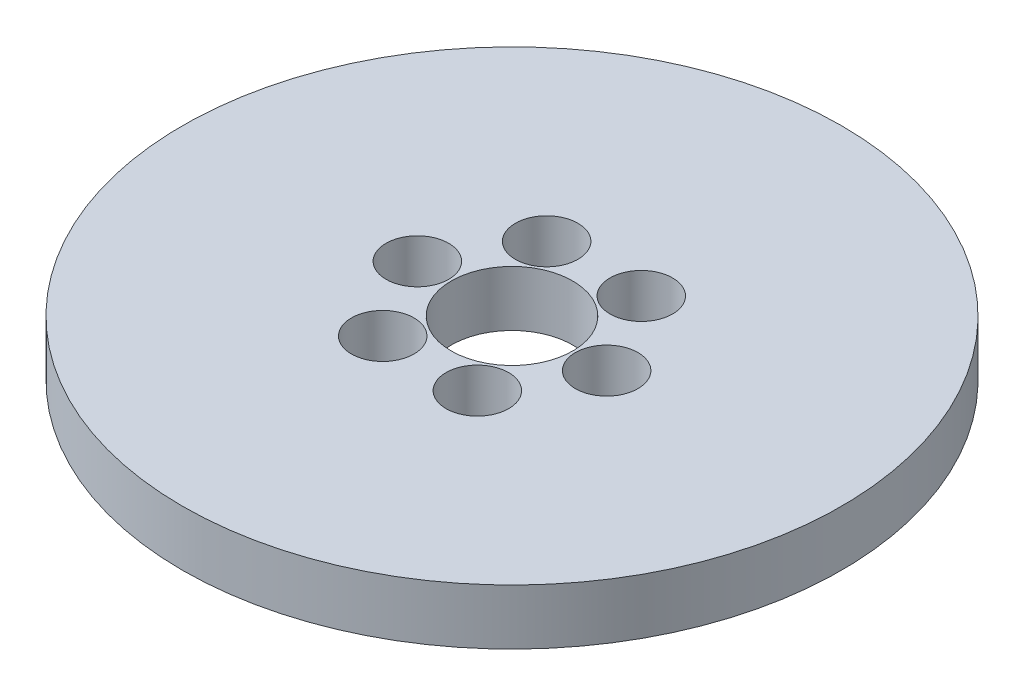
ISO-10303-21;
HEADER;
FILE_DESCRIPTION(('STEP AP214'),'2;1');
FILE_NAME('part.step','',(''),(''),'','','');
FILE_SCHEMA(('AUTOMOTIVE_DESIGN { 1 0 10303 214 1 1 1 1 }'));
ENDSEC;
DATA;
#1=APPLICATION_CONTEXT('core data for automotive mechanical design processes');
#2=APPLICATION_PROTOCOL_DEFINITION('international standard','automotive_design',2000,#1);
#3=PRODUCT_CONTEXT('',#1,'mechanical');
#4=PRODUCT('Part','Part','',(#3));
#5=PRODUCT_RELATED_PRODUCT_CATEGORY('part','',(#4));
#6=PRODUCT_DEFINITION_FORMATION('','',#4);
#7=PRODUCT_DEFINITION_CONTEXT('part definition',#1,'design');
#8=PRODUCT_DEFINITION('design','',#6,#7);
#9=PRODUCT_DEFINITION_SHAPE('','',#8);
#10=(LENGTH_UNIT() NAMED_UNIT(*) SI_UNIT(.MILLI.,.METRE.));
#11=(NAMED_UNIT(*) PLANE_ANGLE_UNIT() SI_UNIT($,.RADIAN.));
#12=(NAMED_UNIT(*) SI_UNIT($,.STERADIAN.) SOLID_ANGLE_UNIT());
#13=UNCERTAINTY_MEASURE_WITH_UNIT(LENGTH_MEASURE(1.E-05),#10,'distance_accuracy_value','');
#14=(GEOMETRIC_REPRESENTATION_CONTEXT(3) GLOBAL_UNCERTAINTY_ASSIGNED_CONTEXT((#13)) GLOBAL_UNIT_ASSIGNED_CONTEXT((#10,
#11,#12)) REPRESENTATION_CONTEXT('',''));
#15=CARTESIAN_POINT('',(0.,0.,0.));
#16=DIRECTION('',(0.,0.,1.));
#17=DIRECTION('',(1.,0.,0.));
#18=AXIS2_PLACEMENT_3D('',#15,#16,#17);
#19=CARTESIAN_POINT('',(0.,16.,0.));
#20=DIRECTION('',(0.,-1.,0.));
#21=DIRECTION('',(0.,0.,-1.));
#22=AXIS2_PLACEMENT_3D('',#19,#20,#21);
#23=CYLINDRICAL_SURFACE('',#22,95.);
#24=CARTESIAN_POINT('',(0.,16.,0.));
#25=DIRECTION('',(0.,1.,0.));
#26=DIRECTION('',(0.,0.,1.));
#27=AXIS2_PLACEMENT_3D('',#24,#25,#26);
#28=CIRCLE('',#27,95.);
#29=CARTESIAN_POINT('',(0.,16.,95.));
#30=VERTEX_POINT('',#29);
#31=EDGE_CURVE('E10',#30,#30,#28,.T.);
#32=ORIENTED_EDGE('',*,*,#31,.F.);
#33=EDGE_LOOP('',(#32));
#34=FACE_BOUND('',#33,.T.);
#35=CARTESIAN_POINT('',(0.,0.,0.));
#36=DIRECTION('',(0.,1.,0.));
#37=DIRECTION('',(0.,0.,1.));
#38=AXIS2_PLACEMENT_3D('',#35,#36,#37);
#39=CIRCLE('',#38,95.);
#40=CARTESIAN_POINT('',(0.,0.,95.));
#41=VERTEX_POINT('',#40);
#42=EDGE_CURVE('E37',#41,#41,#39,.T.);
#43=ORIENTED_EDGE('',*,*,#42,.T.);
#44=EDGE_LOOP('',(#43));
#45=FACE_BOUND('',#44,.T.);
#46=ADVANCED_FACE('F40',(#34,#45),#23,.T.);
#47=CARTESIAN_POINT('',(0.,16.,0.));
#48=DIRECTION('',(0.,1.,0.));
#49=DIRECTION('',(0.,0.,1.));
#50=AXIS2_PLACEMENT_3D('',#47,#48,#49);
#51=PLANE('',#50);
#52=CARTESIAN_POINT('',(-13.6417250650911,16.,-23.6281609156231));
#53=DIRECTION('',(0.,1.,0.));
#54=DIRECTION('',(-0.866025403784433,0.,0.50000000000001));
#55=AXIS2_PLACEMENT_3D('',#52,#53,#54);
#56=CIRCLE('',#55,9.02133893008124);
#57=CARTESIAN_POINT('',(-21.454433754691,16.,-19.1174914505824));
#58=VERTEX_POINT('',#57);
#59=EDGE_CURVE('E70',#58,#58,#56,.T.);
#60=ORIENTED_EDGE('',*,*,#59,.F.);
#61=EDGE_LOOP('',(#60));
#62=FACE_BOUND('',#61,.T.);
#63=CARTESIAN_POINT('',(13.6417250650906,16.,-23.6281609156234));
#64=DIRECTION('',(0.,1.,0.));
#65=DIRECTION('',(-0.866025403784443,0.,-0.499999999999992));
#66=AXIS2_PLACEMENT_3D('',#63,#64,#65);
#67=CIRCLE('',#66,9.02133893008124);
#68=CARTESIAN_POINT('',(5.82901637549073,16.,-28.1388303806639));
#69=VERTEX_POINT('',#68);
#70=EDGE_CURVE('E71',#69,#69,#67,.T.);
#71=ORIENTED_EDGE('',*,*,#70,.F.);
#72=EDGE_LOOP('',(#71));
#73=FACE_BOUND('',#72,.T.);
#74=CARTESIAN_POINT('',(27.2834501301817,16.,0.));
#75=DIRECTION('',(0.,1.,0.));
#76=DIRECTION('',(0.,0.,-1.));
#77=AXIS2_PLACEMENT_3D('',#74,#75,#76);
#78=CIRCLE('',#77,9.02133893008124);
#79=CARTESIAN_POINT('',(27.2834501301817,16.,-9.02133893008124));
#80=VERTEX_POINT('',#79);
#81=EDGE_CURVE('E78',#80,#80,#78,.T.);
#82=ORIENTED_EDGE('',*,*,#81,.F.);
#83=EDGE_LOOP('',(#82));
#84=FACE_BOUND('',#83,.T.);
#85=CARTESIAN_POINT('',(13.641725065091,16.,23.6281609156232));
#86=DIRECTION('',(0.,1.,0.));
#87=DIRECTION('',(0.866025403784436,0.,-0.500000000000004));
#88=AXIS2_PLACEMENT_3D('',#85,#86,#87);
#89=CIRCLE('',#88,9.02133893008124);
#90=CARTESIAN_POINT('',(21.4544337546908,16.,19.1174914505825));
#91=VERTEX_POINT('',#90);
#92=EDGE_CURVE('E84',#91,#91,#89,.T.);
#93=ORIENTED_EDGE('',*,*,#92,.F.);
#94=EDGE_LOOP('',(#93));
#95=FACE_BOUND('',#94,.T.);
#96=CARTESIAN_POINT('',(-13.6417250650908,16.,23.6281609156233));
#97=DIRECTION('',(0.,1.,0.));
#98=DIRECTION('',(0.86602540378444,0.,0.499999999999998));
#99=AXIS2_PLACEMENT_3D('',#96,#97,#98);
#100=CIRCLE('',#99,9.02133893008124);
#101=CARTESIAN_POINT('',(-5.82901637549092,16.,28.1388303806639));
#102=VERTEX_POINT('',#101);
#103=EDGE_CURVE('E61',#102,#102,#100,.T.);
#104=ORIENTED_EDGE('',*,*,#103,.F.);
#105=EDGE_LOOP('',(#104));
#106=FACE_BOUND('',#105,.T.);
#107=CARTESIAN_POINT('',(-27.2834501301817,16.,0.));
#108=DIRECTION('',(0.,1.,0.));
#109=DIRECTION('',(0.,0.,1.));
#110=AXIS2_PLACEMENT_3D('',#107,#108,#109);
#111=CIRCLE('',#110,9.02133893008124);
#112=CARTESIAN_POINT('',(-27.2834501301817,16.,9.02133893008124));
#113=VERTEX_POINT('',#112);
#114=EDGE_CURVE('E54',#113,#113,#111,.T.);
#115=ORIENTED_EDGE('',*,*,#114,.F.);
#116=EDGE_LOOP('',(#115));
#117=FACE_BOUND('',#116,.T.);
#118=CARTESIAN_POINT('',(0.,16.,0.));
#119=DIRECTION('',(0.,1.,0.));
#120=DIRECTION('',(0.,0.,1.));
#121=AXIS2_PLACEMENT_3D('',#118,#119,#120);
#122=CIRCLE('',#121,17.5);
#123=CARTESIAN_POINT('',(0.,16.,17.5));
#124=VERTEX_POINT('',#123);
#125=EDGE_CURVE('E50',#124,#124,#122,.T.);
#126=ORIENTED_EDGE('',*,*,#125,.F.);
#127=EDGE_LOOP('',(#126));
#128=FACE_BOUND('',#127,.T.);
#129=ORIENTED_EDGE('',*,*,#31,.T.);
#130=EDGE_LOOP('',(#129));
#131=FACE_BOUND('',#130,.T.);
#132=ADVANCED_FACE('F99',(#62,#73,#84,#95,#106,#117,#128,#131),#51,.T.);
#133=CARTESIAN_POINT('',(0.,0.,0.));
#134=DIRECTION('',(0.,1.,0.));
#135=DIRECTION('',(0.,0.,1.));
#136=AXIS2_PLACEMENT_3D('',#133,#134,#135);
#137=PLANE('',#136);
#138=CARTESIAN_POINT('',(0.,0.,0.));
#139=DIRECTION('',(0.,1.,0.));
#140=DIRECTION('',(0.,0.,1.));
#141=AXIS2_PLACEMENT_3D('',#138,#139,#140);
#142=CIRCLE('',#141,17.5);
#143=CARTESIAN_POINT('',(0.,0.,17.5));
#144=VERTEX_POINT('',#143);
#145=EDGE_CURVE('E47',#144,#144,#142,.T.);
#146=ORIENTED_EDGE('',*,*,#145,.T.);
#147=EDGE_LOOP('',(#146));
#148=FACE_BOUND('',#147,.T.);
#149=ORIENTED_EDGE('',*,*,#42,.F.);
#150=EDGE_LOOP('',(#149));
#151=FACE_BOUND('',#150,.T.);
#152=ADVANCED_FACE('F103',(#148,#151),#137,.F.);
#153=CARTESIAN_POINT('',(0.,16.,0.));
#154=DIRECTION('',(0.,-1.,0.));
#155=DIRECTION('',(0.,0.,-1.));
#156=AXIS2_PLACEMENT_3D('',#153,#154,#155);
#157=CYLINDRICAL_SURFACE('',#156,17.5);
#158=ORIENTED_EDGE('',*,*,#125,.T.);
#159=EDGE_LOOP('',(#158));
#160=FACE_BOUND('',#159,.T.);
#161=ORIENTED_EDGE('',*,*,#145,.F.);
#162=EDGE_LOOP('',(#161));
#163=FACE_BOUND('',#162,.T.);
#164=ADVANCED_FACE('F115',(#160,#163),#157,.F.);
#165=CARTESIAN_POINT('',(-27.2834501301817,0.0606863577741236,0.));
#166=DIRECTION('',(0.,1.,0.));
#167=DIRECTION('',(0.,0.,1.));
#168=AXIS2_PLACEMENT_3D('',#165,#166,#167);
#169=CYLINDRICAL_SURFACE('',#168,9.02133893008124);
#170=CARTESIAN_POINT('',(-27.2834501301817,0.0606863577741236,0.));
#171=DIRECTION('',(0.,1.,0.));
#172=DIRECTION('',(0.,0.,1.));
#173=AXIS2_PLACEMENT_3D('',#170,#171,#172);
#174=CIRCLE('',#173,9.02133893008124);
#175=CARTESIAN_POINT('',(-27.2834501301817,0.0606863577741236,9.02133893008124));
#176=VERTEX_POINT('',#175);
#177=EDGE_CURVE('E55',#176,#176,#174,.T.);
#178=ORIENTED_EDGE('',*,*,#177,.F.);
#179=EDGE_LOOP('',(#178));
#180=FACE_BOUND('',#179,.T.);
#181=ORIENTED_EDGE('',*,*,#114,.T.);
#182=EDGE_LOOP('',(#181));
#183=FACE_BOUND('',#182,.T.);
#184=ADVANCED_FACE('F113',(#180,#183),#169,.F.);
#185=CARTESIAN_POINT('',(-27.2834501301817,0.0606863577741236,0.));
#186=DIRECTION('',(0.,1.,0.));
#187=DIRECTION('',(0.,0.,1.));
#188=AXIS2_PLACEMENT_3D('',#185,#186,#187);
#189=PLANE('',#188);
#190=ORIENTED_EDGE('',*,*,#177,.T.);
#191=EDGE_LOOP('',(#190));
#192=FACE_BOUND('',#191,.T.);
#193=ADVANCED_FACE('F144',(#192),#189,.T.);
#194=CARTESIAN_POINT('',(-13.6417250650908,0.0606863577741236,23.6281609156233));
#195=DIRECTION('',(0.,1.,0.));
#196=DIRECTION('',(0.,0.,1.));
#197=AXIS2_PLACEMENT_3D('',#194,#195,#196);
#198=CYLINDRICAL_SURFACE('',#197,9.02133893008124);
#199=CARTESIAN_POINT('',(-13.6417250650908,0.0606863577741236,23.6281609156233));
#200=DIRECTION('',(0.,1.,0.));
#201=DIRECTION('',(0.86602540378444,0.,0.499999999999998));
#202=AXIS2_PLACEMENT_3D('',#199,#200,#201);
#203=CIRCLE('',#202,9.02133893008124);
#204=CARTESIAN_POINT('',(-5.82901637549092,0.0606863577741236,28.1388303806639));
#205=VERTEX_POINT('',#204);
#206=EDGE_CURVE('E59',#205,#205,#203,.T.);
#207=ORIENTED_EDGE('',*,*,#206,.F.);
#208=EDGE_LOOP('',(#207));
#209=FACE_BOUND('',#208,.T.);
#210=ORIENTED_EDGE('',*,*,#103,.T.);
#211=EDGE_LOOP('',(#210));
#212=FACE_BOUND('',#211,.T.);
#213=ADVANCED_FACE('F153',(#209,#212),#198,.F.);
#214=CARTESIAN_POINT('',(-13.6417250650908,0.0606863577741236,23.6281609156233));
#215=DIRECTION('',(0.,1.,0.));
#216=DIRECTION('',(0.86602540378444,0.,0.499999999999998));
#217=AXIS2_PLACEMENT_3D('',#214,#215,#216);
#218=PLANE('',#217);
#219=ORIENTED_EDGE('',*,*,#206,.T.);
#220=EDGE_LOOP('',(#219));
#221=FACE_BOUND('',#220,.T.);
#222=ADVANCED_FACE('F96',(#221),#218,.T.);
#223=CARTESIAN_POINT('',(13.641725065091,0.0606863577741236,23.6281609156232));
#224=DIRECTION('',(0.,1.,0.));
#225=DIRECTION('',(0.,0.,1.));
#226=AXIS2_PLACEMENT_3D('',#223,#224,#225);
#227=CYLINDRICAL_SURFACE('',#226,9.02133893008124);
#228=CARTESIAN_POINT('',(13.641725065091,0.0606863577741236,23.6281609156232));
#229=DIRECTION('',(0.,1.,0.));
#230=DIRECTION('',(0.866025403784436,0.,-0.500000000000004));
#231=AXIS2_PLACEMENT_3D('',#228,#229,#230);
#232=CIRCLE('',#231,9.02133893008124);
#233=CARTESIAN_POINT('',(21.4544337546908,0.0606863577741236,19.1174914505825));
#234=VERTEX_POINT('',#233);
#235=EDGE_CURVE('E63',#234,#234,#232,.T.);
#236=ORIENTED_EDGE('',*,*,#235,.F.);
#237=EDGE_LOOP('',(#236));
#238=FACE_BOUND('',#237,.T.);
#239=ORIENTED_EDGE('',*,*,#92,.T.);
#240=EDGE_LOOP('',(#239));
#241=FACE_BOUND('',#240,.T.);
#242=ADVANCED_FACE('F91',(#238,#241),#227,.F.);
#243=CARTESIAN_POINT('',(13.641725065091,0.0606863577741236,23.6281609156232));
#244=DIRECTION('',(0.,1.,0.));
#245=DIRECTION('',(0.866025403784436,0.,-0.500000000000004));
#246=AXIS2_PLACEMENT_3D('',#243,#244,#245);
#247=PLANE('',#246);
#248=ORIENTED_EDGE('',*,*,#235,.T.);
#249=EDGE_LOOP('',(#248));
#250=FACE_BOUND('',#249,.T.);
#251=ADVANCED_FACE('F93',(#250),#247,.T.);
#252=CARTESIAN_POINT('',(27.2834501301817,0.0606863577741236,0.));
#253=DIRECTION('',(0.,1.,0.));
#254=DIRECTION('',(0.,0.,1.));
#255=AXIS2_PLACEMENT_3D('',#252,#253,#254);
#256=CYLINDRICAL_SURFACE('',#255,9.02133893008124);
#257=CARTESIAN_POINT('',(27.2834501301817,0.0606863577741236,0.));
#258=DIRECTION('',(0.,1.,0.));
#259=DIRECTION('',(0.,0.,-1.));
#260=AXIS2_PLACEMENT_3D('',#257,#258,#259);
#261=CIRCLE('',#260,9.02133893008124);
#262=CARTESIAN_POINT('',(27.2834501301817,0.0606863577741236,-9.02133893008124));
#263=VERTEX_POINT('',#262);
#264=EDGE_CURVE('E85',#263,#263,#261,.T.);
#265=ORIENTED_EDGE('',*,*,#264,.F.);
#266=EDGE_LOOP('',(#265));
#267=FACE_BOUND('',#266,.T.);
#268=ORIENTED_EDGE('',*,*,#81,.T.);
#269=EDGE_LOOP('',(#268));
#270=FACE_BOUND('',#269,.T.);
#271=ADVANCED_FACE('F187',(#267,#270),#256,.F.);
#272=CARTESIAN_POINT('',(27.2834501301817,0.0606863577741236,0.));
#273=DIRECTION('',(0.,1.,0.));
#274=DIRECTION('',(0.,0.,-1.));
#275=AXIS2_PLACEMENT_3D('',#272,#273,#274);
#276=PLANE('',#275);
#277=ORIENTED_EDGE('',*,*,#264,.T.);
#278=EDGE_LOOP('',(#277));
#279=FACE_BOUND('',#278,.T.);
#280=ADVANCED_FACE('F198',(#279),#276,.T.);
#281=CARTESIAN_POINT('',(13.6417250650906,0.0606863577741236,-23.6281609156234));
#282=DIRECTION('',(0.,1.,0.));
#283=DIRECTION('',(0.,0.,1.));
#284=AXIS2_PLACEMENT_3D('',#281,#282,#283);
#285=CYLINDRICAL_SURFACE('',#284,9.02133893008124);
#286=CARTESIAN_POINT('',(13.6417250650906,0.0606863577741236,-23.6281609156234));
#287=DIRECTION('',(0.,1.,0.));
#288=DIRECTION('',(-0.866025403784443,0.,-0.499999999999992));
#289=AXIS2_PLACEMENT_3D('',#286,#287,#288);
#290=CIRCLE('',#289,9.02133893008124);
#291=CARTESIAN_POINT('',(5.82901637549073,0.0606863577741236,-28.1388303806639));
#292=VERTEX_POINT('',#291);
#293=EDGE_CURVE('E76',#292,#292,#290,.T.);
#294=ORIENTED_EDGE('',*,*,#293,.F.);
#295=EDGE_LOOP('',(#294));
#296=FACE_BOUND('',#295,.T.);
#297=ORIENTED_EDGE('',*,*,#70,.T.);
#298=EDGE_LOOP('',(#297));
#299=FACE_BOUND('',#298,.T.);
#300=ADVANCED_FACE('F202',(#296,#299),#285,.F.);
#301=CARTESIAN_POINT('',(13.6417250650906,0.0606863577741236,-23.6281609156234));
#302=DIRECTION('',(0.,1.,0.));
#303=DIRECTION('',(-0.866025403784443,0.,-0.499999999999992));
#304=AXIS2_PLACEMENT_3D('',#301,#302,#303);
#305=PLANE('',#304);
#306=ORIENTED_EDGE('',*,*,#293,.T.);
#307=EDGE_LOOP('',(#306));
#308=FACE_BOUND('',#307,.T.);
#309=ADVANCED_FACE('F212',(#308),#305,.T.);
#310=CARTESIAN_POINT('',(-13.6417250650911,0.0606863577741236,-23.6281609156231));
#311=DIRECTION('',(0.,1.,0.));
#312=DIRECTION('',(0.,0.,1.));
#313=AXIS2_PLACEMENT_3D('',#310,#311,#312);
#314=CYLINDRICAL_SURFACE('',#313,9.02133893008124);
#315=CARTESIAN_POINT('',(-13.6417250650911,0.0606863577741236,-23.6281609156231));
#316=DIRECTION('',(0.,1.,0.));
#317=DIRECTION('',(-0.866025403784433,0.,0.50000000000001));
#318=AXIS2_PLACEMENT_3D('',#315,#316,#317);
#319=CIRCLE('',#318,9.02133893008124);
#320=CARTESIAN_POINT('',(-21.454433754691,0.0606863577741236,-19.1174914505824));
#321=VERTEX_POINT('',#320);
#322=EDGE_CURVE('E69',#321,#321,#319,.T.);
#323=ORIENTED_EDGE('',*,*,#322,.F.);
#324=EDGE_LOOP('',(#323));
#325=FACE_BOUND('',#324,.T.);
#326=ORIENTED_EDGE('',*,*,#59,.T.);
#327=EDGE_LOOP('',(#326));
#328=FACE_BOUND('',#327,.T.);
#329=ADVANCED_FACE('F224',(#325,#328),#314,.F.);
#330=CARTESIAN_POINT('',(-13.6417250650911,0.0606863577741236,-23.6281609156231));
#331=DIRECTION('',(0.,1.,0.));
#332=DIRECTION('',(-0.866025403784433,0.,0.50000000000001));
#333=AXIS2_PLACEMENT_3D('',#330,#331,#332);
#334=PLANE('',#333);
#335=ORIENTED_EDGE('',*,*,#322,.T.);
#336=EDGE_LOOP('',(#335));
#337=FACE_BOUND('',#336,.T.);
#338=ADVANCED_FACE('F235',(#337),#334,.T.);
#339=CLOSED_SHELL('',(#46,#132,#152,#164,#184,#193,#213,#222,#242,#251,#271,#280,#300,#309,#329,#338));
#340=MANIFOLD_SOLID_BREP('B2',#339);
#341=ADVANCED_BREP_SHAPE_REPRESENTATION('',(#18,#340),#14);
#342=SHAPE_DEFINITION_REPRESENTATION(#9,#341);
ENDSEC;
END-ISO-10303-21;
